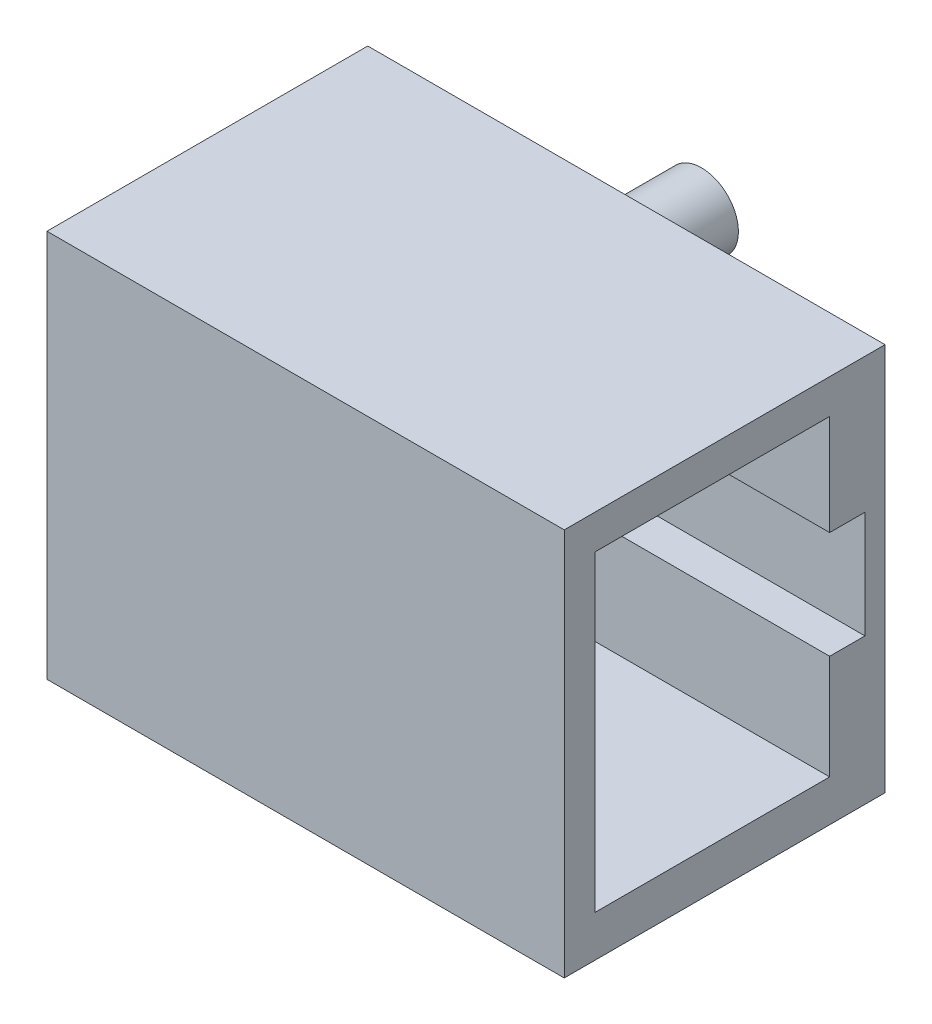
ISO-10303-21;
HEADER;
FILE_DESCRIPTION(('STEP AP214'),'2;1');
FILE_NAME('part.step','',(''),(''),'','','');
FILE_SCHEMA(('AUTOMOTIVE_DESIGN { 1 0 10303 214 1 1 1 1 }'));
ENDSEC;
DATA;
#1=APPLICATION_CONTEXT('core data for automotive mechanical design processes');
#2=APPLICATION_PROTOCOL_DEFINITION('international standard','automotive_design',2000,#1);
#3=PRODUCT_CONTEXT('',#1,'mechanical');
#4=PRODUCT('Part','Part','',(#3));
#5=PRODUCT_RELATED_PRODUCT_CATEGORY('part','',(#4));
#6=PRODUCT_DEFINITION_FORMATION('','',#4);
#7=PRODUCT_DEFINITION_CONTEXT('part definition',#1,'design');
#8=PRODUCT_DEFINITION('design','',#6,#7);
#9=PRODUCT_DEFINITION_SHAPE('','',#8);
#10=(LENGTH_UNIT() NAMED_UNIT(*) SI_UNIT(.MILLI.,.METRE.));
#11=(NAMED_UNIT(*) PLANE_ANGLE_UNIT() SI_UNIT($,.RADIAN.));
#12=(NAMED_UNIT(*) SI_UNIT($,.STERADIAN.) SOLID_ANGLE_UNIT());
#13=UNCERTAINTY_MEASURE_WITH_UNIT(LENGTH_MEASURE(1.E-05),#10,'distance_accuracy_value','');
#14=(GEOMETRIC_REPRESENTATION_CONTEXT(3) GLOBAL_UNCERTAINTY_ASSIGNED_CONTEXT((#13)) GLOBAL_UNIT_ASSIGNED_CONTEXT((#10,
#11,#12)) REPRESENTATION_CONTEXT('',''));
#15=CARTESIAN_POINT('',(0.,0.,0.));
#16=DIRECTION('',(0.,0.,1.));
#17=DIRECTION('',(1.,0.,0.));
#18=AXIS2_PLACEMENT_3D('',#15,#16,#17);
#19=CARTESIAN_POINT('',(0.,-15.8,0.));
#20=DIRECTION('',(0.,0.,1.));
#21=DIRECTION('',(1.,0.,0.));
#22=AXIS2_PLACEMENT_3D('',#19,#20,#21);
#23=PLANE('',#22);
#24=CARTESIAN_POINT('',(10.34,-2.25,0.));
#25=DIRECTION('',(0.,0.,1.));
#26=DIRECTION('',(1.,0.,0.));
#27=AXIS2_PLACEMENT_3D('',#24,#25,#26);
#28=CIRCLE('',#27,1.5);
#29=CARTESIAN_POINT('',(11.84,-2.25,0.));
#30=VERTEX_POINT('',#29);
#31=EDGE_CURVE('E37',#30,#30,#28,.F.);
#32=ORIENTED_EDGE('',*,*,#31,.F.);
#33=EDGE_LOOP('',(#32));
#34=FACE_BOUND('',#33,.T.);
#35=DIRECTION('',(0.,-1.,0.));
#36=VECTOR('',#35,1.);
#37=CARTESIAN_POINT('',(0.,0.,0.));
#38=LINE('',#37,#36);
#39=CARTESIAN_POINT('',(0.,0.,0.));
#40=VERTEX_POINT('',#39);
#41=CARTESIAN_POINT('',(0.,-15.8,0.));
#42=VERTEX_POINT('',#41);
#43=EDGE_CURVE('E198',#40,#42,#38,.T.);
#44=ORIENTED_EDGE('',*,*,#43,.F.);
#45=DIRECTION('',(-1.,0.,0.));
#46=VECTOR('',#45,1.);
#47=CARTESIAN_POINT('',(0.,0.,0.));
#48=LINE('',#47,#46);
#49=CARTESIAN_POINT('',(21.06,0.,0.));
#50=VERTEX_POINT('',#49);
#51=EDGE_CURVE('E205',#50,#40,#48,.T.);
#52=ORIENTED_EDGE('',*,*,#51,.F.);
#53=DIRECTION('',(0.,1.,0.));
#54=VECTOR('',#53,1.);
#55=CARTESIAN_POINT('',(21.06,0.,0.));
#56=LINE('',#55,#54);
#57=CARTESIAN_POINT('',(21.06,-15.8,0.));
#58=VERTEX_POINT('',#57);
#59=EDGE_CURVE('E203',#58,#50,#56,.T.);
#60=ORIENTED_EDGE('',*,*,#59,.F.);
#61=DIRECTION('',(1.,0.,0.));
#62=VECTOR('',#61,1.);
#63=CARTESIAN_POINT('',(0.,-15.8,0.));
#64=LINE('',#63,#62);
#65=EDGE_CURVE('E201',#42,#58,#64,.T.);
#66=ORIENTED_EDGE('',*,*,#65,.F.);
#67=EDGE_LOOP('',(#44,#52,#60,#66));
#68=FACE_BOUND('',#67,.T.);
#69=CARTESIAN_POINT('',(10.34,-13.68,0.));
#70=DIRECTION('',(0.,0.,1.));
#71=DIRECTION('',(1.,0.,0.));
#72=AXIS2_PLACEMENT_3D('',#69,#70,#71);
#73=CIRCLE('',#72,1.5);
#74=CARTESIAN_POINT('',(11.84,-13.68,0.));
#75=VERTEX_POINT('',#74);
#76=EDGE_CURVE('E11',#75,#75,#73,.F.);
#77=ORIENTED_EDGE('',*,*,#76,.F.);
#78=EDGE_LOOP('',(#77));
#79=FACE_BOUND('',#78,.T.);
#80=ADVANCED_FACE('F29',(#34,#68,#79),#23,.F.);
#81=CARTESIAN_POINT('',(0.,0.,13.06));
#82=DIRECTION('',(1.,0.,0.));
#83=DIRECTION('',(0.,1.,0.));
#84=AXIS2_PLACEMENT_3D('',#81,#82,#83);
#85=PLANE('',#84);
#86=ORIENTED_EDGE('',*,*,#43,.T.);
#87=DIRECTION('',(0.,0.,-1.));
#88=VECTOR('',#87,1.);
#89=CARTESIAN_POINT('',(0.,-15.8,13.06));
#90=LINE('',#89,#88);
#91=CARTESIAN_POINT('',(0.,-15.8,13.06));
#92=VERTEX_POINT('',#91);
#93=EDGE_CURVE('E223',#92,#42,#90,.T.);
#94=ORIENTED_EDGE('',*,*,#93,.F.);
#95=DIRECTION('',(0.,-1.,0.));
#96=VECTOR('',#95,1.);
#97=CARTESIAN_POINT('',(0.,0.,13.06));
#98=LINE('',#97,#96);
#99=CARTESIAN_POINT('',(0.,0.,13.06));
#100=VERTEX_POINT('',#99);
#101=EDGE_CURVE('E207',#100,#92,#98,.T.);
#102=ORIENTED_EDGE('',*,*,#101,.F.);
#103=DIRECTION('',(0.,0.,-1.));
#104=VECTOR('',#103,1.);
#105=CARTESIAN_POINT('',(0.,0.,13.06));
#106=LINE('',#105,#104);
#107=EDGE_CURVE('E214',#100,#40,#106,.T.);
#108=ORIENTED_EDGE('',*,*,#107,.T.);
#109=EDGE_LOOP('',(#86,#94,#102,#108));
#110=FACE_BOUND('',#109,.T.);
#111=ADVANCED_FACE('F31',(#110),#85,.F.);
#112=CARTESIAN_POINT('',(0.,-15.8,13.06));
#113=DIRECTION('',(0.,1.,0.));
#114=DIRECTION('',(0.,0.,1.));
#115=AXIS2_PLACEMENT_3D('',#112,#113,#114);
#116=PLANE('',#115);
#117=ORIENTED_EDGE('',*,*,#65,.T.);
#118=DIRECTION('',(0.,0.,-1.));
#119=VECTOR('',#118,1.);
#120=CARTESIAN_POINT('',(21.06,-15.8,13.06));
#121=LINE('',#120,#119);
#122=CARTESIAN_POINT('',(21.06,-15.8,13.06));
#123=VERTEX_POINT('',#122);
#124=EDGE_CURVE('E220',#123,#58,#121,.T.);
#125=ORIENTED_EDGE('',*,*,#124,.F.);
#126=DIRECTION('',(1.,0.,0.));
#127=VECTOR('',#126,1.);
#128=CARTESIAN_POINT('',(0.,-15.8,13.06));
#129=LINE('',#128,#127);
#130=EDGE_CURVE('E209',#92,#123,#129,.T.);
#131=ORIENTED_EDGE('',*,*,#130,.F.);
#132=ORIENTED_EDGE('',*,*,#93,.T.);
#133=EDGE_LOOP('',(#117,#125,#131,#132));
#134=FACE_BOUND('',#133,.T.);
#135=ADVANCED_FACE('F267',(#134),#116,.F.);
#136=CARTESIAN_POINT('',(21.06,0.,13.06));
#137=DIRECTION('',(-1.,0.,0.));
#138=DIRECTION('',(0.,-1.,0.));
#139=AXIS2_PLACEMENT_3D('',#136,#137,#138);
#140=PLANE('',#139);
#141=DIRECTION('',(0.,1.,0.));
#142=VECTOR('',#141,1.);
#143=CARTESIAN_POINT('',(21.06,-9.85878894767786,2.25487377667123));
#144=LINE('',#143,#142);
#145=CARTESIAN_POINT('',(21.06,-14.1131721824532,2.25487377667122));
#146=VERTEX_POINT('',#145);
#147=CARTESIAN_POINT('',(21.06,-9.85878894767786,2.25487377667123));
#148=VERTEX_POINT('',#147);
#149=EDGE_CURVE('E134',#146,#148,#144,.T.);
#150=ORIENTED_EDGE('',*,*,#149,.F.);
#151=DIRECTION('',(0.,0.,-1.));
#152=VECTOR('',#151,1.);
#153=CARTESIAN_POINT('',(21.06,-14.1131721824532,2.25487377667122));
#154=LINE('',#153,#152);
#155=CARTESIAN_POINT('',(21.06,-14.1131721824532,11.8095094581043));
#156=VERTEX_POINT('',#155);
#157=EDGE_CURVE('E44',#156,#146,#154,.T.);
#158=ORIENTED_EDGE('',*,*,#157,.F.);
#159=DIRECTION('',(0.,-1.,0.));
#160=VECTOR('',#159,1.);
#161=CARTESIAN_POINT('',(21.06,-14.1131721824532,11.8095094581043));
#162=LINE('',#161,#160);
#163=CARTESIAN_POINT('',(21.06,-1.40320226856175,11.8095094581043));
#164=VERTEX_POINT('',#163);
#165=EDGE_CURVE('E156',#164,#156,#162,.T.);
#166=ORIENTED_EDGE('',*,*,#165,.F.);
#167=DIRECTION('',(0.,0.,1.));
#168=VECTOR('',#167,1.);
#169=CARTESIAN_POINT('',(21.06,-1.40320226856175,11.8095094581043));
#170=LINE('',#169,#168);
#171=CARTESIAN_POINT('',(21.06,-1.40320226856175,2.25487377667124));
#172=VERTEX_POINT('',#171);
#173=EDGE_CURVE('E153',#172,#164,#170,.T.);
#174=ORIENTED_EDGE('',*,*,#173,.F.);
#175=DIRECTION('',(0.,1.,0.));
#176=VECTOR('',#175,1.);
#177=CARTESIAN_POINT('',(21.06,-1.40320226856175,2.25487377667124));
#178=LINE('',#177,#176);
#179=CARTESIAN_POINT('',(21.06,-5.49804613203306,2.25487377667124));
#180=VERTEX_POINT('',#179);
#181=EDGE_CURVE('E150',#180,#172,#178,.T.);
#182=ORIENTED_EDGE('',*,*,#181,.F.);
#183=DIRECTION('',(0.,0.,1.));
#184=VECTOR('',#183,1.);
#185=CARTESIAN_POINT('',(21.06,-5.49804613203306,2.25487377667124));
#186=LINE('',#185,#184);
#187=CARTESIAN_POINT('',(21.06,-5.49804613203306,0.819019434934541));
#188=VERTEX_POINT('',#187);
#189=EDGE_CURVE('E144',#188,#180,#186,.T.);
#190=ORIENTED_EDGE('',*,*,#189,.F.);
#191=DIRECTION('',(0.,1.,0.));
#192=VECTOR('',#191,1.);
#193=CARTESIAN_POINT('',(21.06,-5.49804613203306,0.819019434934541));
#194=LINE('',#193,#192);
#195=CARTESIAN_POINT('',(21.06,-9.85878894767783,0.819019434934541));
#196=VERTEX_POINT('',#195);
#197=EDGE_CURVE('E142',#196,#188,#194,.T.);
#198=ORIENTED_EDGE('',*,*,#197,.F.);
#199=DIRECTION('',(0.,0.,-1.));
#200=VECTOR('',#199,1.);
#201=CARTESIAN_POINT('',(21.06,-9.85878894767783,0.819019434934541));
#202=LINE('',#201,#200);
#203=EDGE_CURVE('E123',#148,#196,#202,.T.);
#204=ORIENTED_EDGE('',*,*,#203,.F.);
#205=EDGE_LOOP('',(#150,#158,#166,#174,#182,#190,#198,#204));
#206=FACE_BOUND('',#205,.T.);
#207=ORIENTED_EDGE('',*,*,#59,.T.);
#208=DIRECTION('',(0.,0.,-1.));
#209=VECTOR('',#208,1.);
#210=CARTESIAN_POINT('',(21.06,0.,13.06));
#211=LINE('',#210,#209);
#212=CARTESIAN_POINT('',(21.06,0.,13.06));
#213=VERTEX_POINT('',#212);
#214=EDGE_CURVE('E217',#213,#50,#211,.T.);
#215=ORIENTED_EDGE('',*,*,#214,.F.);
#216=DIRECTION('',(0.,1.,0.));
#217=VECTOR('',#216,1.);
#218=CARTESIAN_POINT('',(21.06,0.,13.06));
#219=LINE('',#218,#217);
#220=EDGE_CURVE('E211',#123,#213,#219,.T.);
#221=ORIENTED_EDGE('',*,*,#220,.F.);
#222=ORIENTED_EDGE('',*,*,#124,.T.);
#223=EDGE_LOOP('',(#207,#215,#221,#222));
#224=FACE_BOUND('',#223,.T.);
#225=ADVANCED_FACE('F138',(#206,#224),#140,.F.);
#226=CARTESIAN_POINT('',(0.,0.,13.06));
#227=DIRECTION('',(0.,-1.,0.));
#228=DIRECTION('',(0.,0.,-1.));
#229=AXIS2_PLACEMENT_3D('',#226,#227,#228);
#230=PLANE('',#229);
#231=ORIENTED_EDGE('',*,*,#51,.T.);
#232=ORIENTED_EDGE('',*,*,#107,.F.);
#233=DIRECTION('',(-1.,0.,0.));
#234=VECTOR('',#233,1.);
#235=CARTESIAN_POINT('',(0.,0.,13.06));
#236=LINE('',#235,#234);
#237=EDGE_CURVE('E52',#213,#100,#236,.T.);
#238=ORIENTED_EDGE('',*,*,#237,.F.);
#239=ORIENTED_EDGE('',*,*,#214,.T.);
#240=EDGE_LOOP('',(#231,#232,#238,#239));
#241=FACE_BOUND('',#240,.T.);
#242=ADVANCED_FACE('F262',(#241),#230,.F.);
#243=CARTESIAN_POINT('',(0.,-15.8,13.06));
#244=DIRECTION('',(0.,0.,1.));
#245=DIRECTION('',(1.,0.,0.));
#246=AXIS2_PLACEMENT_3D('',#243,#244,#245);
#247=PLANE('',#246);
#248=ORIENTED_EDGE('',*,*,#101,.T.);
#249=ORIENTED_EDGE('',*,*,#130,.T.);
#250=ORIENTED_EDGE('',*,*,#220,.T.);
#251=ORIENTED_EDGE('',*,*,#237,.T.);
#252=EDGE_LOOP('',(#248,#249,#250,#251));
#253=FACE_BOUND('',#252,.T.);
#254=ADVANCED_FACE('F257',(#253),#247,.T.);
#255=CARTESIAN_POINT('',(10.34,-2.25,-3.25));
#256=DIRECTION('',(0.,0.,1.));
#257=DIRECTION('',(1.,0.,0.));
#258=AXIS2_PLACEMENT_3D('',#255,#256,#257);
#259=CYLINDRICAL_SURFACE('',#258,1.5);
#260=CARTESIAN_POINT('',(10.34,-2.25,-3.25));
#261=DIRECTION('',(0.,0.,-1.));
#262=DIRECTION('',(-1.,0.,0.));
#263=AXIS2_PLACEMENT_3D('',#260,#261,#262);
#264=CIRCLE('',#263,1.5);
#265=CARTESIAN_POINT('',(8.84,-2.25,-3.25));
#266=VERTEX_POINT('',#265);
#267=EDGE_CURVE('E195',#266,#266,#264,.T.);
#268=ORIENTED_EDGE('',*,*,#267,.F.);
#269=EDGE_LOOP('',(#268));
#270=FACE_BOUND('',#269,.T.);
#271=ORIENTED_EDGE('',*,*,#31,.T.);
#272=EDGE_LOOP('',(#271));
#273=FACE_BOUND('',#272,.T.);
#274=ADVANCED_FACE('F228',(#270,#273),#259,.T.);
#275=CARTESIAN_POINT('',(10.34,-2.25,-3.25));
#276=DIRECTION('',(0.,0.,-1.));
#277=DIRECTION('',(-1.,0.,0.));
#278=AXIS2_PLACEMENT_3D('',#275,#276,#277);
#279=PLANE('',#278);
#280=ORIENTED_EDGE('',*,*,#267,.T.);
#281=EDGE_LOOP('',(#280));
#282=FACE_BOUND('',#281,.T.);
#283=ADVANCED_FACE('F241',(#282),#279,.T.);
#284=CARTESIAN_POINT('',(10.34,-13.68,-3.25));
#285=DIRECTION('',(0.,0.,1.));
#286=DIRECTION('',(1.,0.,0.));
#287=AXIS2_PLACEMENT_3D('',#284,#285,#286);
#288=CYLINDRICAL_SURFACE('',#287,1.5);
#289=CARTESIAN_POINT('',(10.34,-13.68,-3.25));
#290=DIRECTION('',(0.,0.,-1.));
#291=DIRECTION('',(-1.,0.,0.));
#292=AXIS2_PLACEMENT_3D('',#289,#290,#291);
#293=CIRCLE('',#292,1.5);
#294=CARTESIAN_POINT('',(8.84,-13.68,-3.25));
#295=VERTEX_POINT('',#294);
#296=EDGE_CURVE('E182',#295,#295,#293,.T.);
#297=ORIENTED_EDGE('',*,*,#296,.F.);
#298=EDGE_LOOP('',(#297));
#299=FACE_BOUND('',#298,.T.);
#300=ORIENTED_EDGE('',*,*,#76,.T.);
#301=EDGE_LOOP('',(#300));
#302=FACE_BOUND('',#301,.T.);
#303=ADVANCED_FACE('F238',(#299,#302),#288,.T.);
#304=CARTESIAN_POINT('',(10.34,-13.68,-3.25));
#305=DIRECTION('',(0.,0.,-1.));
#306=DIRECTION('',(-1.,0.,0.));
#307=AXIS2_PLACEMENT_3D('',#304,#305,#306);
#308=PLANE('',#307);
#309=ORIENTED_EDGE('',*,*,#296,.T.);
#310=EDGE_LOOP('',(#309));
#311=FACE_BOUND('',#310,.T.);
#312=ADVANCED_FACE('F240',(#311),#308,.T.);
#313=CARTESIAN_POINT('',(3.06,-14.1131721824532,2.25487377667122));
#314=DIRECTION('',(0.,-1.,0.));
#315=DIRECTION('',(1.,0.,0.));
#316=AXIS2_PLACEMENT_3D('',#313,#314,#315);
#317=PLANE('',#316);
#318=ORIENTED_EDGE('',*,*,#157,.T.);
#319=DIRECTION('',(1.,0.,0.));
#320=VECTOR('',#319,1.);
#321=CARTESIAN_POINT('',(3.06,-14.1131721824532,2.25487377667122));
#322=LINE('',#321,#320);
#323=CARTESIAN_POINT('',(3.06,-14.1131721824532,2.25487377667122));
#324=VERTEX_POINT('',#323);
#325=EDGE_CURVE('E131',#324,#146,#322,.T.);
#326=ORIENTED_EDGE('',*,*,#325,.F.);
#327=DIRECTION('',(0.,0.,-1.));
#328=VECTOR('',#327,1.);
#329=CARTESIAN_POINT('',(3.06,-14.1131721824532,2.25487377667122));
#330=LINE('',#329,#328);
#331=CARTESIAN_POINT('',(3.06,-14.1131721824532,11.8095094581043));
#332=VERTEX_POINT('',#331);
#333=EDGE_CURVE('E159',#332,#324,#330,.T.);
#334=ORIENTED_EDGE('',*,*,#333,.F.);
#335=DIRECTION('',(1.,0.,0.));
#336=VECTOR('',#335,1.);
#337=CARTESIAN_POINT('',(3.06,-14.1131721824532,11.8095094581043));
#338=LINE('',#337,#336);
#339=EDGE_CURVE('E180',#332,#156,#338,.T.);
#340=ORIENTED_EDGE('',*,*,#339,.T.);
#341=EDGE_LOOP('',(#318,#326,#334,#340));
#342=FACE_BOUND('',#341,.T.);
#343=ADVANCED_FACE('F248',(#342),#317,.F.);
#344=CARTESIAN_POINT('',(3.06,-14.1131721824532,11.8095094581043));
#345=DIRECTION('',(0.,0.,1.));
#346=DIRECTION('',(1.,0.,0.));
#347=AXIS2_PLACEMENT_3D('',#344,#345,#346);
#348=PLANE('',#347);
#349=ORIENTED_EDGE('',*,*,#165,.T.);
#350=ORIENTED_EDGE('',*,*,#339,.F.);
#351=DIRECTION('',(0.,-1.,0.));
#352=VECTOR('',#351,1.);
#353=CARTESIAN_POINT('',(3.06,-14.1131721824532,11.8095094581043));
#354=LINE('',#353,#352);
#355=CARTESIAN_POINT('',(3.06,-1.40320226856175,11.8095094581043));
#356=VERTEX_POINT('',#355);
#357=EDGE_CURVE('E177',#356,#332,#354,.T.);
#358=ORIENTED_EDGE('',*,*,#357,.F.);
#359=DIRECTION('',(1.,0.,0.));
#360=VECTOR('',#359,1.);
#361=CARTESIAN_POINT('',(3.06,-1.40320226856175,11.8095094581043));
#362=LINE('',#361,#360);
#363=EDGE_CURVE('E183',#356,#164,#362,.T.);
#364=ORIENTED_EDGE('',*,*,#363,.T.);
#365=EDGE_LOOP('',(#349,#350,#358,#364));
#366=FACE_BOUND('',#365,.T.);
#367=ADVANCED_FACE('F329',(#366),#348,.F.);
#368=CARTESIAN_POINT('',(3.06,-1.40320226856175,11.8095094581043));
#369=DIRECTION('',(0.,1.,0.));
#370=DIRECTION('',(-1.,0.,0.));
#371=AXIS2_PLACEMENT_3D('',#368,#369,#370);
#372=PLANE('',#371);
#373=ORIENTED_EDGE('',*,*,#173,.T.);
#374=ORIENTED_EDGE('',*,*,#363,.F.);
#375=DIRECTION('',(0.,0.,1.));
#376=VECTOR('',#375,1.);
#377=CARTESIAN_POINT('',(3.06,-1.40320226856175,11.8095094581043));
#378=LINE('',#377,#376);
#379=CARTESIAN_POINT('',(3.06,-1.40320226856175,2.25487377667124));
#380=VERTEX_POINT('',#379);
#381=EDGE_CURVE('E174',#380,#356,#378,.T.);
#382=ORIENTED_EDGE('',*,*,#381,.F.);
#383=DIRECTION('',(1.,0.,0.));
#384=VECTOR('',#383,1.);
#385=CARTESIAN_POINT('',(3.06,-1.40320226856175,2.25487377667124));
#386=LINE('',#385,#384);
#387=EDGE_CURVE('E185',#380,#172,#386,.T.);
#388=ORIENTED_EDGE('',*,*,#387,.T.);
#389=EDGE_LOOP('',(#373,#374,#382,#388));
#390=FACE_BOUND('',#389,.T.);
#391=ADVANCED_FACE('F337',(#390),#372,.F.);
#392=CARTESIAN_POINT('',(3.06,-1.40320226856175,2.25487377667124));
#393=DIRECTION('',(0.,0.,-1.));
#394=DIRECTION('',(-1.,0.,0.));
#395=AXIS2_PLACEMENT_3D('',#392,#393,#394);
#396=PLANE('',#395);
#397=ORIENTED_EDGE('',*,*,#181,.T.);
#398=ORIENTED_EDGE('',*,*,#387,.F.);
#399=DIRECTION('',(0.,1.,0.));
#400=VECTOR('',#399,1.);
#401=CARTESIAN_POINT('',(3.06,-1.40320226856175,2.25487377667124));
#402=LINE('',#401,#400);
#403=CARTESIAN_POINT('',(3.06,-5.49804613203307,2.25487377667124));
#404=VERTEX_POINT('',#403);
#405=EDGE_CURVE('E171',#404,#380,#402,.T.);
#406=ORIENTED_EDGE('',*,*,#405,.F.);
#407=DIRECTION('',(1.,0.,0.));
#408=VECTOR('',#407,1.);
#409=CARTESIAN_POINT('',(3.06,-5.49804613203307,2.25487377667124));
#410=LINE('',#409,#408);
#411=EDGE_CURVE('E187',#404,#180,#410,.T.);
#412=ORIENTED_EDGE('',*,*,#411,.T.);
#413=EDGE_LOOP('',(#397,#398,#406,#412));
#414=FACE_BOUND('',#413,.T.);
#415=ADVANCED_FACE('F347',(#414),#396,.F.);
#416=CARTESIAN_POINT('',(3.06,-5.49804613203307,2.25487377667124));
#417=DIRECTION('',(0.,1.,0.));
#418=DIRECTION('',(-1.,0.,0.));
#419=AXIS2_PLACEMENT_3D('',#416,#417,#418);
#420=PLANE('',#419);
#421=ORIENTED_EDGE('',*,*,#189,.T.);
#422=ORIENTED_EDGE('',*,*,#411,.F.);
#423=DIRECTION('',(0.,0.,1.));
#424=VECTOR('',#423,1.);
#425=CARTESIAN_POINT('',(3.06,-5.49804613203307,2.25487377667124));
#426=LINE('',#425,#424);
#427=CARTESIAN_POINT('',(3.06,-5.49804613203307,0.819019434934541));
#428=VERTEX_POINT('',#427);
#429=EDGE_CURVE('E168',#428,#404,#426,.T.);
#430=ORIENTED_EDGE('',*,*,#429,.F.);
#431=DIRECTION('',(1.,0.,0.));
#432=VECTOR('',#431,1.);
#433=CARTESIAN_POINT('',(3.06,-5.49804613203307,0.819019434934541));
#434=LINE('',#433,#432);
#435=EDGE_CURVE('E189',#428,#188,#434,.T.);
#436=ORIENTED_EDGE('',*,*,#435,.T.);
#437=EDGE_LOOP('',(#421,#422,#430,#436));
#438=FACE_BOUND('',#437,.T.);
#439=ADVANCED_FACE('F357',(#438),#420,.F.);
#440=CARTESIAN_POINT('',(3.06,-5.49804613203307,0.819019434934541));
#441=DIRECTION('',(0.,0.,-1.));
#442=DIRECTION('',(-1.,0.,0.));
#443=AXIS2_PLACEMENT_3D('',#440,#441,#442);
#444=PLANE('',#443);
#445=ORIENTED_EDGE('',*,*,#197,.T.);
#446=ORIENTED_EDGE('',*,*,#435,.F.);
#447=DIRECTION('',(0.,1.,0.));
#448=VECTOR('',#447,1.);
#449=CARTESIAN_POINT('',(3.06,-5.49804613203307,0.819019434934541));
#450=LINE('',#449,#448);
#451=CARTESIAN_POINT('',(3.06,-9.85878894767784,0.819019434934541));
#452=VERTEX_POINT('',#451);
#453=EDGE_CURVE('E165',#452,#428,#450,.T.);
#454=ORIENTED_EDGE('',*,*,#453,.F.);
#455=DIRECTION('',(1.,0.,0.));
#456=VECTOR('',#455,1.);
#457=CARTESIAN_POINT('',(3.06,-9.85878894767784,0.819019434934541));
#458=LINE('',#457,#456);
#459=EDGE_CURVE('E130',#452,#196,#458,.T.);
#460=ORIENTED_EDGE('',*,*,#459,.T.);
#461=EDGE_LOOP('',(#445,#446,#454,#460));
#462=FACE_BOUND('',#461,.T.);
#463=ADVANCED_FACE('F367',(#462),#444,.F.);
#464=CARTESIAN_POINT('',(3.06,-9.85878894767784,0.819019434934541));
#465=DIRECTION('',(0.,-1.,0.));
#466=DIRECTION('',(0.,0.,-1.));
#467=AXIS2_PLACEMENT_3D('',#464,#465,#466);
#468=PLANE('',#467);
#469=ORIENTED_EDGE('',*,*,#203,.T.);
#470=ORIENTED_EDGE('',*,*,#459,.F.);
#471=DIRECTION('',(0.,0.,-1.));
#472=VECTOR('',#471,1.);
#473=CARTESIAN_POINT('',(3.06,-9.85878894767784,0.819019434934541));
#474=LINE('',#473,#472);
#475=CARTESIAN_POINT('',(3.06,-9.85878894767787,2.25487377667123));
#476=VERTEX_POINT('',#475);
#477=EDGE_CURVE('E126',#476,#452,#474,.T.);
#478=ORIENTED_EDGE('',*,*,#477,.F.);
#479=DIRECTION('',(1.,0.,0.));
#480=VECTOR('',#479,1.);
#481=CARTESIAN_POINT('',(3.06,-9.85878894767787,2.25487377667123));
#482=LINE('',#481,#480);
#483=EDGE_CURVE('E119',#476,#148,#482,.T.);
#484=ORIENTED_EDGE('',*,*,#483,.T.);
#485=EDGE_LOOP('',(#469,#470,#478,#484));
#486=FACE_BOUND('',#485,.T.);
#487=ADVANCED_FACE('F121',(#486),#468,.F.);
#488=CARTESIAN_POINT('',(3.06,-9.85878894767787,2.25487377667123));
#489=DIRECTION('',(0.,0.,-1.));
#490=DIRECTION('',(0.,1.,0.));
#491=AXIS2_PLACEMENT_3D('',#488,#489,#490);
#492=PLANE('',#491);
#493=ORIENTED_EDGE('',*,*,#149,.T.);
#494=ORIENTED_EDGE('',*,*,#483,.F.);
#495=DIRECTION('',(0.,1.,0.));
#496=VECTOR('',#495,1.);
#497=CARTESIAN_POINT('',(3.06,-9.85878894767787,2.25487377667123));
#498=LINE('',#497,#496);
#499=EDGE_CURVE('E162',#324,#476,#498,.T.);
#500=ORIENTED_EDGE('',*,*,#499,.F.);
#501=ORIENTED_EDGE('',*,*,#325,.T.);
#502=EDGE_LOOP('',(#493,#494,#500,#501));
#503=FACE_BOUND('',#502,.T.);
#504=ADVANCED_FACE('F135',(#503),#492,.F.);
#505=CARTESIAN_POINT('',(3.06,-14.1131721824532,11.8095094581043));
#506=DIRECTION('',(-1.,0.,0.));
#507=DIRECTION('',(0.,-1.,0.));
#508=AXIS2_PLACEMENT_3D('',#505,#506,#507);
#509=PLANE('',#508);
#510=ORIENTED_EDGE('',*,*,#333,.T.);
#511=ORIENTED_EDGE('',*,*,#499,.T.);
#512=ORIENTED_EDGE('',*,*,#477,.T.);
#513=ORIENTED_EDGE('',*,*,#453,.T.);
#514=ORIENTED_EDGE('',*,*,#429,.T.);
#515=ORIENTED_EDGE('',*,*,#405,.T.);
#516=ORIENTED_EDGE('',*,*,#381,.T.);
#517=ORIENTED_EDGE('',*,*,#357,.T.);
#518=EDGE_LOOP('',(#510,#511,#512,#513,#514,#515,#516,#517));
#519=FACE_BOUND('',#518,.T.);
#520=ADVANCED_FACE('F394',(#519),#509,.F.);
#521=CLOSED_SHELL('',(#80,#111,#135,#225,#242,#254,#274,#283,#303,#312,#343,#367,#391,#415,#439,
#463,#487,#504,#520));
#522=MANIFOLD_SOLID_BREP('B2',#521);
#523=ADVANCED_BREP_SHAPE_REPRESENTATION('',(#18,#522),#14);
#524=SHAPE_DEFINITION_REPRESENTATION(#9,#523);
ENDSEC;
END-ISO-10303-21;
